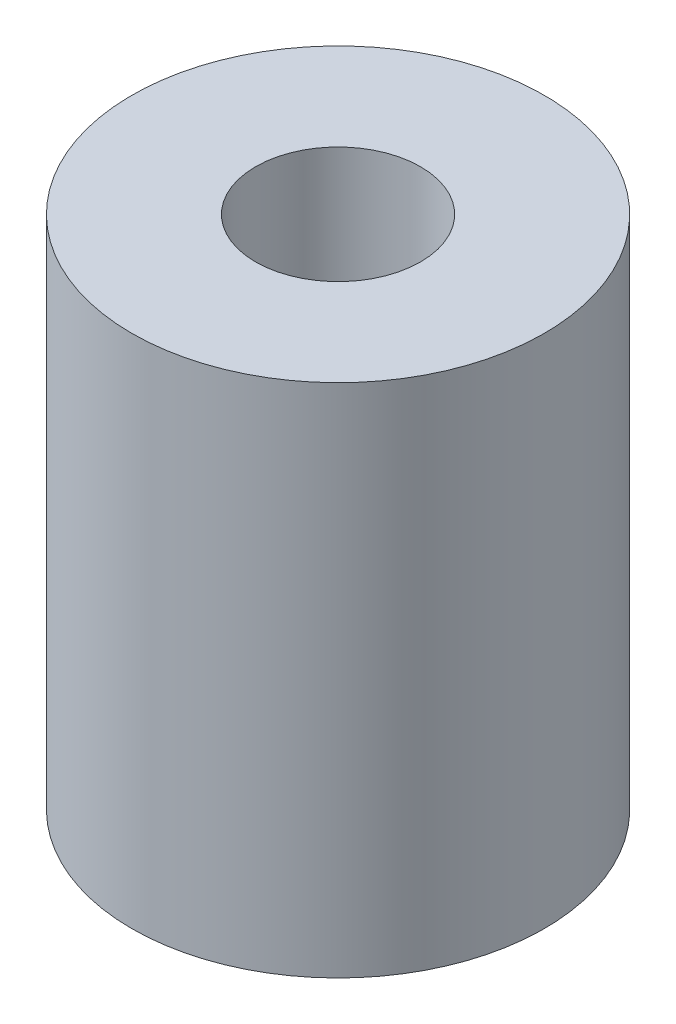
ISO-10303-21;
HEADER;
FILE_DESCRIPTION(('STEP AP214'),'2;1');
FILE_NAME('part.step','',(''),(''),'','','');
FILE_SCHEMA(('AUTOMOTIVE_DESIGN { 1 0 10303 214 1 1 1 1 }'));
ENDSEC;
DATA;
#1=APPLICATION_CONTEXT('core data for automotive mechanical design processes');
#2=APPLICATION_PROTOCOL_DEFINITION('international standard','automotive_design',2000,#1);
#3=PRODUCT_CONTEXT('',#1,'mechanical');
#4=PRODUCT('Part','Part','',(#3));
#5=PRODUCT_RELATED_PRODUCT_CATEGORY('part','',(#4));
#6=PRODUCT_DEFINITION_FORMATION('','',#4);
#7=PRODUCT_DEFINITION_CONTEXT('part definition',#1,'design');
#8=PRODUCT_DEFINITION('design','',#6,#7);
#9=PRODUCT_DEFINITION_SHAPE('','',#8);
#10=(LENGTH_UNIT() NAMED_UNIT(*) SI_UNIT(.MILLI.,.METRE.));
#11=(NAMED_UNIT(*) PLANE_ANGLE_UNIT() SI_UNIT($,.RADIAN.));
#12=(NAMED_UNIT(*) SI_UNIT($,.STERADIAN.) SOLID_ANGLE_UNIT());
#13=UNCERTAINTY_MEASURE_WITH_UNIT(LENGTH_MEASURE(1.E-05),#10,'distance_accuracy_value','');
#14=(GEOMETRIC_REPRESENTATION_CONTEXT(3) GLOBAL_UNCERTAINTY_ASSIGNED_CONTEXT((#13)) GLOBAL_UNIT_ASSIGNED_CONTEXT((#10,
#11,#12)) REPRESENTATION_CONTEXT('',''));
#15=CARTESIAN_POINT('',(0.,0.,0.));
#16=DIRECTION('',(0.,0.,1.));
#17=DIRECTION('',(1.,0.,0.));
#18=AXIS2_PLACEMENT_3D('',#15,#16,#17);
#19=CARTESIAN_POINT('',(0.,10.,0.));
#20=DIRECTION('',(0.,1.,0.));
#21=DIRECTION('',(0.,0.,1.));
#22=AXIS2_PLACEMENT_3D('',#19,#20,#21);
#23=PLANE('',#22);
#24=CARTESIAN_POINT('',(0.,10.,0.));
#25=DIRECTION('',(0.,1.,0.));
#26=DIRECTION('',(0.,0.,1.));
#27=AXIS2_PLACEMENT_3D('',#24,#25,#26);
#28=CIRCLE('',#27,4.);
#29=CARTESIAN_POINT('',(0.,10.,4.));
#30=VERTEX_POINT('',#29);
#31=EDGE_CURVE('E10',#30,#30,#28,.T.);
#32=ORIENTED_EDGE('',*,*,#31,.T.);
#33=EDGE_LOOP('',(#32));
#34=FACE_BOUND('',#33,.T.);
#35=CARTESIAN_POINT('',(0.,10.,0.));
#36=DIRECTION('',(0.,1.,0.));
#37=DIRECTION('',(0.,0.,1.));
#38=AXIS2_PLACEMENT_3D('',#35,#36,#37);
#39=CIRCLE('',#38,1.6);
#40=CARTESIAN_POINT('',(0.,10.,1.6));
#41=VERTEX_POINT('',#40);
#42=EDGE_CURVE('E42',#41,#41,#39,.T.);
#43=ORIENTED_EDGE('',*,*,#42,.F.);
#44=EDGE_LOOP('',(#43));
#45=FACE_BOUND('',#44,.T.);
#46=ADVANCED_FACE('F31',(#34,#45),#23,.T.);
#47=CARTESIAN_POINT('',(0.,0.,0.));
#48=DIRECTION('',(0.,1.,0.));
#49=DIRECTION('',(0.,0.,1.));
#50=AXIS2_PLACEMENT_3D('',#47,#48,#49);
#51=PLANE('',#50);
#52=CARTESIAN_POINT('',(0.,0.,0.));
#53=DIRECTION('',(0.,1.,0.));
#54=DIRECTION('',(0.,0.,1.));
#55=AXIS2_PLACEMENT_3D('',#52,#53,#54);
#56=CIRCLE('',#55,4.);
#57=CARTESIAN_POINT('',(0.,0.,4.));
#58=VERTEX_POINT('',#57);
#59=EDGE_CURVE('E35',#58,#58,#56,.T.);
#60=ORIENTED_EDGE('',*,*,#59,.F.);
#61=EDGE_LOOP('',(#60));
#62=FACE_BOUND('',#61,.T.);
#63=CARTESIAN_POINT('',(0.,0.,0.));
#64=DIRECTION('',(0.,1.,0.));
#65=DIRECTION('',(0.,0.,1.));
#66=AXIS2_PLACEMENT_3D('',#63,#64,#65);
#67=CIRCLE('',#66,1.6);
#68=CARTESIAN_POINT('',(0.,0.,1.6));
#69=VERTEX_POINT('',#68);
#70=EDGE_CURVE('E44',#69,#69,#67,.T.);
#71=ORIENTED_EDGE('',*,*,#70,.T.);
#72=EDGE_LOOP('',(#71));
#73=FACE_BOUND('',#72,.T.);
#74=ADVANCED_FACE('F54',(#62,#73),#51,.F.);
#75=CARTESIAN_POINT('',(0.,10.,0.));
#76=DIRECTION('',(0.,-1.,0.));
#77=DIRECTION('',(0.,0.,-1.));
#78=AXIS2_PLACEMENT_3D('',#75,#76,#77);
#79=CYLINDRICAL_SURFACE('',#78,4.);
#80=ORIENTED_EDGE('',*,*,#31,.F.);
#81=EDGE_LOOP('',(#80));
#82=FACE_BOUND('',#81,.T.);
#83=ORIENTED_EDGE('',*,*,#59,.T.);
#84=EDGE_LOOP('',(#83));
#85=FACE_BOUND('',#84,.T.);
#86=ADVANCED_FACE('F33',(#82,#85),#79,.T.);
#87=CARTESIAN_POINT('',(0.,10.,0.));
#88=DIRECTION('',(0.,-1.,0.));
#89=DIRECTION('',(0.,0.,-1.));
#90=AXIS2_PLACEMENT_3D('',#87,#88,#89);
#91=CYLINDRICAL_SURFACE('',#90,1.6);
#92=ORIENTED_EDGE('',*,*,#42,.T.);
#93=EDGE_LOOP('',(#92));
#94=FACE_BOUND('',#93,.T.);
#95=ORIENTED_EDGE('',*,*,#70,.F.);
#96=EDGE_LOOP('',(#95));
#97=FACE_BOUND('',#96,.T.);
#98=ADVANCED_FACE('F50',(#94,#97),#91,.F.);
#99=CLOSED_SHELL('',(#46,#74,#86,#98));
#100=MANIFOLD_SOLID_BREP('B2',#99);
#101=ADVANCED_BREP_SHAPE_REPRESENTATION('',(#18,#100),#14);
#102=SHAPE_DEFINITION_REPRESENTATION(#9,#101);
ENDSEC;
END-ISO-10303-21;
